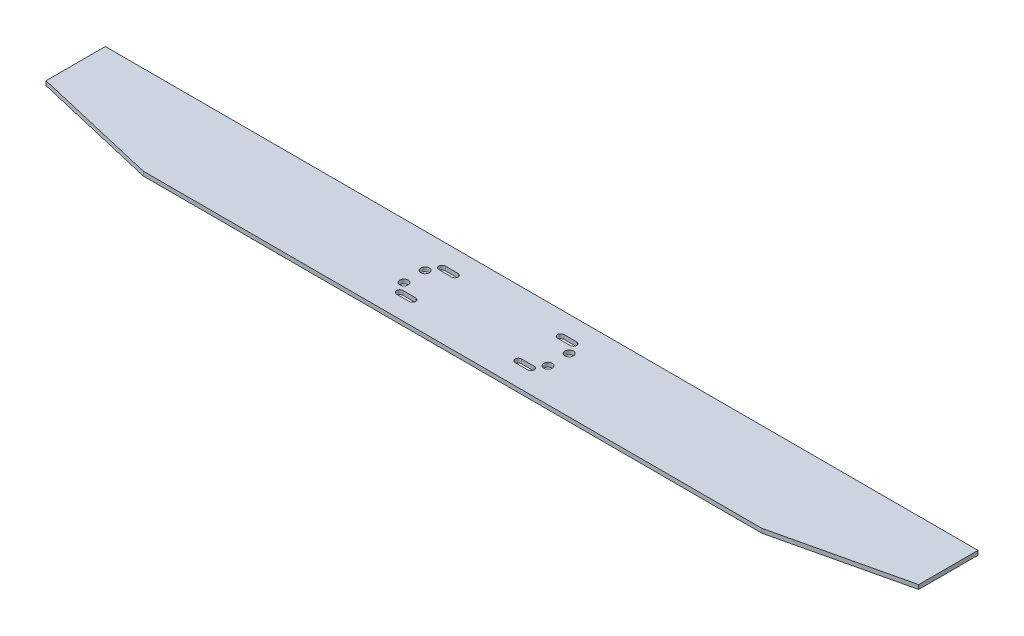
ISO-10303-21;
HEADER;
FILE_DESCRIPTION(('STEP AP214'),'2;1');
FILE_NAME('part.step','',(''),(''),'','','');
FILE_SCHEMA(('AUTOMOTIVE_DESIGN { 1 0 10303 214 1 1 1 1 }'));
ENDSEC;
DATA;
#1=APPLICATION_CONTEXT('core data for automotive mechanical design processes');
#2=APPLICATION_PROTOCOL_DEFINITION('international standard','automotive_design',2000,#1);
#3=PRODUCT_CONTEXT('',#1,'mechanical');
#4=PRODUCT('Part','Part','',(#3));
#5=PRODUCT_RELATED_PRODUCT_CATEGORY('part','',(#4));
#6=PRODUCT_DEFINITION_FORMATION('','',#4);
#7=PRODUCT_DEFINITION_CONTEXT('part definition',#1,'design');
#8=PRODUCT_DEFINITION('design','',#6,#7);
#9=PRODUCT_DEFINITION_SHAPE('','',#8);
#10=(LENGTH_UNIT() NAMED_UNIT(*) SI_UNIT(.MILLI.,.METRE.));
#11=(NAMED_UNIT(*) PLANE_ANGLE_UNIT() SI_UNIT($,.RADIAN.));
#12=(NAMED_UNIT(*) SI_UNIT($,.STERADIAN.) SOLID_ANGLE_UNIT());
#13=UNCERTAINTY_MEASURE_WITH_UNIT(LENGTH_MEASURE(1.E-05),#10,'distance_accuracy_value','');
#14=(GEOMETRIC_REPRESENTATION_CONTEXT(3) GLOBAL_UNCERTAINTY_ASSIGNED_CONTEXT((#13)) GLOBAL_UNIT_ASSIGNED_CONTEXT((#10,
#11,#12)) REPRESENTATION_CONTEXT('',''));
#15=CARTESIAN_POINT('',(0.,0.,0.));
#16=DIRECTION('',(0.,0.,1.));
#17=DIRECTION('',(1.,0.,0.));
#18=AXIS2_PLACEMENT_3D('',#15,#16,#17);
#19=CARTESIAN_POINT('',(-103.,0.5,14.));
#20=DIRECTION('',(0.227229615606418,0.,-0.973841209741793));
#21=DIRECTION('',(-0.973841209741793,0.,-0.227229615606418));
#22=AXIS2_PLACEMENT_3D('',#19,#20,#21);
#23=PLANE('',#22);
#24=DIRECTION('',(0.973841209741793,0.,0.227229615606418));
#25=VECTOR('',#24,1.);
#26=CARTESIAN_POINT('',(-103.,-0.5,14.));
#27=LINE('',#26,#25);
#28=CARTESIAN_POINT('',(-103.,-0.5,14.));
#29=VERTEX_POINT('',#28);
#30=CARTESIAN_POINT('',(-73.,-0.5,21.));
#31=VERTEX_POINT('',#30);
#32=EDGE_CURVE('E285',#29,#31,#27,.T.);
#33=ORIENTED_EDGE('',*,*,#32,.T.);
#34=DIRECTION('',(0.,-1.,0.));
#35=VECTOR('',#34,1.);
#36=CARTESIAN_POINT('',(-73.,0.5,21.));
#37=LINE('',#36,#35);
#38=CARTESIAN_POINT('',(-73.,0.5,21.));
#39=VERTEX_POINT('',#38);
#40=EDGE_CURVE('E11',#39,#31,#37,.T.);
#41=ORIENTED_EDGE('',*,*,#40,.F.);
#42=DIRECTION('',(0.973841209741793,0.,0.227229615606418));
#43=VECTOR('',#42,1.);
#44=CARTESIAN_POINT('',(-103.,0.5,14.));
#45=LINE('',#44,#43);
#46=CARTESIAN_POINT('',(-103.,0.5,14.));
#47=VERTEX_POINT('',#46);
#48=EDGE_CURVE('E293',#47,#39,#45,.T.);
#49=ORIENTED_EDGE('',*,*,#48,.F.);
#50=DIRECTION('',(0.,-1.,0.));
#51=VECTOR('',#50,1.);
#52=CARTESIAN_POINT('',(-103.,0.5,14.));
#53=LINE('',#52,#51);
#54=EDGE_CURVE('E307',#47,#29,#53,.T.);
#55=ORIENTED_EDGE('',*,*,#54,.T.);
#56=EDGE_LOOP('',(#33,#41,#49,#55));
#57=FACE_BOUND('',#56,.T.);
#58=ADVANCED_FACE('F35',(#57),#23,.F.);
#59=CARTESIAN_POINT('',(-73.,0.5,21.));
#60=DIRECTION('',(0.,0.,-1.));
#61=DIRECTION('',(-1.,0.,0.));
#62=AXIS2_PLACEMENT_3D('',#59,#60,#61);
#63=PLANE('',#62);
#64=DIRECTION('',(1.,0.,0.));
#65=VECTOR('',#64,1.);
#66=CARTESIAN_POINT('',(-73.,-0.5,21.));
#67=LINE('',#66,#65);
#68=CARTESIAN_POINT('',(73.,-0.5,21.));
#69=VERTEX_POINT('',#68);
#70=EDGE_CURVE('E310',#31,#69,#67,.T.);
#71=ORIENTED_EDGE('',*,*,#70,.T.);
#72=DIRECTION('',(0.,-1.,0.));
#73=VECTOR('',#72,1.);
#74=CARTESIAN_POINT('',(73.,0.5,21.));
#75=LINE('',#74,#73);
#76=CARTESIAN_POINT('',(73.,0.5,21.));
#77=VERTEX_POINT('',#76);
#78=EDGE_CURVE('E42',#77,#69,#75,.T.);
#79=ORIENTED_EDGE('',*,*,#78,.F.);
#80=DIRECTION('',(1.,0.,0.));
#81=VECTOR('',#80,1.);
#82=CARTESIAN_POINT('',(-73.,0.5,21.));
#83=LINE('',#82,#81);
#84=EDGE_CURVE('E296',#39,#77,#83,.T.);
#85=ORIENTED_EDGE('',*,*,#84,.F.);
#86=ORIENTED_EDGE('',*,*,#40,.T.);
#87=EDGE_LOOP('',(#71,#79,#85,#86));
#88=FACE_BOUND('',#87,.T.);
#89=ADVANCED_FACE('F356',(#88),#63,.F.);
#90=CARTESIAN_POINT('',(73.,0.5,21.));
#91=DIRECTION('',(-0.227229615606419,0.,-0.973841209741793));
#92=DIRECTION('',(-0.973841209741793,0.,0.227229615606419));
#93=AXIS2_PLACEMENT_3D('',#90,#91,#92);
#94=PLANE('',#93);
#95=DIRECTION('',(0.973841209741793,0.,-0.227229615606419));
#96=VECTOR('',#95,1.);
#97=CARTESIAN_POINT('',(73.,-0.5,21.));
#98=LINE('',#97,#96);
#99=CARTESIAN_POINT('',(103.,-0.5,14.));
#100=VERTEX_POINT('',#99);
#101=EDGE_CURVE('E312',#69,#100,#98,.T.);
#102=ORIENTED_EDGE('',*,*,#101,.T.);
#103=DIRECTION('',(0.,-1.,0.));
#104=VECTOR('',#103,1.);
#105=CARTESIAN_POINT('',(103.,0.5,14.));
#106=LINE('',#105,#104);
#107=CARTESIAN_POINT('',(103.,0.5,14.));
#108=VERTEX_POINT('',#107);
#109=EDGE_CURVE('E327',#108,#100,#106,.T.);
#110=ORIENTED_EDGE('',*,*,#109,.F.);
#111=DIRECTION('',(0.973841209741793,0.,-0.227229615606419));
#112=VECTOR('',#111,1.);
#113=CARTESIAN_POINT('',(73.,0.5,21.));
#114=LINE('',#113,#112);
#115=EDGE_CURVE('E299',#77,#108,#114,.T.);
#116=ORIENTED_EDGE('',*,*,#115,.F.);
#117=ORIENTED_EDGE('',*,*,#78,.T.);
#118=EDGE_LOOP('',(#102,#110,#116,#117));
#119=FACE_BOUND('',#118,.T.);
#120=ADVANCED_FACE('F334',(#119),#94,.F.);
#121=CARTESIAN_POINT('',(103.,0.5,14.));
#122=DIRECTION('',(-1.,0.,0.));
#123=DIRECTION('',(0.,0.,1.));
#124=AXIS2_PLACEMENT_3D('',#121,#122,#123);
#125=PLANE('',#124);
#126=DIRECTION('',(0.,0.,-1.));
#127=VECTOR('',#126,1.);
#128=CARTESIAN_POINT('',(103.,-0.5,14.));
#129=LINE('',#128,#127);
#130=CARTESIAN_POINT('',(103.,-0.5,0.));
#131=VERTEX_POINT('',#130);
#132=EDGE_CURVE('E314',#100,#131,#129,.T.);
#133=ORIENTED_EDGE('',*,*,#132,.T.);
#134=DIRECTION('',(0.,-1.,0.));
#135=VECTOR('',#134,1.);
#136=CARTESIAN_POINT('',(103.,0.5,0.));
#137=LINE('',#136,#135);
#138=CARTESIAN_POINT('',(103.,0.5,0.));
#139=VERTEX_POINT('',#138);
#140=EDGE_CURVE('E324',#139,#131,#137,.T.);
#141=ORIENTED_EDGE('',*,*,#140,.F.);
#142=DIRECTION('',(0.,0.,-1.));
#143=VECTOR('',#142,1.);
#144=CARTESIAN_POINT('',(103.,0.5,14.));
#145=LINE('',#144,#143);
#146=EDGE_CURVE('E301',#108,#139,#145,.T.);
#147=ORIENTED_EDGE('',*,*,#146,.F.);
#148=ORIENTED_EDGE('',*,*,#109,.T.);
#149=EDGE_LOOP('',(#133,#141,#147,#148));
#150=FACE_BOUND('',#149,.T.);
#151=ADVANCED_FACE('F345',(#150),#125,.F.);
#152=CARTESIAN_POINT('',(103.,0.5,0.));
#153=DIRECTION('',(0.,0.,1.));
#154=DIRECTION('',(1.,0.,0.));
#155=AXIS2_PLACEMENT_3D('',#152,#153,#154);
#156=PLANE('',#155);
#157=DIRECTION('',(-1.,0.,0.));
#158=VECTOR('',#157,1.);
#159=CARTESIAN_POINT('',(103.,-0.5,0.));
#160=LINE('',#159,#158);
#161=CARTESIAN_POINT('',(-103.,-0.5,0.));
#162=VERTEX_POINT('',#161);
#163=EDGE_CURVE('E316',#131,#162,#160,.T.);
#164=ORIENTED_EDGE('',*,*,#163,.T.);
#165=DIRECTION('',(0.,-1.,0.));
#166=VECTOR('',#165,1.);
#167=CARTESIAN_POINT('',(-103.,0.5,0.));
#168=LINE('',#167,#166);
#169=CARTESIAN_POINT('',(-103.,0.5,0.));
#170=VERTEX_POINT('',#169);
#171=EDGE_CURVE('E321',#170,#162,#168,.T.);
#172=ORIENTED_EDGE('',*,*,#171,.F.);
#173=DIRECTION('',(-1.,0.,0.));
#174=VECTOR('',#173,1.);
#175=CARTESIAN_POINT('',(103.,0.5,0.));
#176=LINE('',#175,#174);
#177=EDGE_CURVE('E303',#139,#170,#176,.T.);
#178=ORIENTED_EDGE('',*,*,#177,.F.);
#179=ORIENTED_EDGE('',*,*,#140,.T.);
#180=EDGE_LOOP('',(#164,#172,#178,#179));
#181=FACE_BOUND('',#180,.T.);
#182=ADVANCED_FACE('F349',(#181),#156,.F.);
#183=CARTESIAN_POINT('',(-103.,0.5,0.));
#184=DIRECTION('',(1.,0.,0.));
#185=DIRECTION('',(0.,0.,-1.));
#186=AXIS2_PLACEMENT_3D('',#183,#184,#185);
#187=PLANE('',#186);
#188=DIRECTION('',(0.,0.,1.));
#189=VECTOR('',#188,1.);
#190=CARTESIAN_POINT('',(-103.,-0.5,0.));
#191=LINE('',#190,#189);
#192=EDGE_CURVE('E297',#162,#29,#191,.T.);
#193=ORIENTED_EDGE('',*,*,#192,.T.);
#194=ORIENTED_EDGE('',*,*,#54,.F.);
#195=DIRECTION('',(0.,0.,1.));
#196=VECTOR('',#195,1.);
#197=CARTESIAN_POINT('',(-103.,0.5,0.));
#198=LINE('',#197,#196);
#199=EDGE_CURVE('E305',#170,#47,#198,.T.);
#200=ORIENTED_EDGE('',*,*,#199,.F.);
#201=ORIENTED_EDGE('',*,*,#171,.T.);
#202=EDGE_LOOP('',(#193,#194,#200,#201));
#203=FACE_BOUND('',#202,.T.);
#204=ADVANCED_FACE('F359',(#203),#187,.F.);
#205=CARTESIAN_POINT('',(0.,0.5,0.));
#206=DIRECTION('',(0.,1.,0.));
#207=DIRECTION('',(0.,0.,1.));
#208=AXIS2_PLACEMENT_3D('',#205,#206,#207);
#209=PLANE('',#208);
#210=CARTESIAN_POINT('',(10.,0.5,5.49999999999997));
#211=DIRECTION('',(0.,1.,0.));
#212=DIRECTION('',(0.,0.,1.));
#213=AXIS2_PLACEMENT_3D('',#210,#211,#212);
#214=CIRCLE('',#213,0.75);
#215=CARTESIAN_POINT('',(10.,0.5,4.74999999999997));
#216=VERTEX_POINT('',#215);
#217=CARTESIAN_POINT('',(10.,0.5,6.24999999999997));
#218=VERTEX_POINT('',#217);
#219=EDGE_CURVE('E611',#216,#218,#214,.T.);
#220=ORIENTED_EDGE('',*,*,#219,.F.);
#221=DIRECTION('',(-1.,0.,0.));
#222=VECTOR('',#221,1.);
#223=CARTESIAN_POINT('',(10.,0.5,4.74999999999997));
#224=LINE('',#223,#222);
#225=CARTESIAN_POINT('',(13.,0.5,4.74999999999997));
#226=VERTEX_POINT('',#225);
#227=EDGE_CURVE('E217',#226,#216,#224,.T.);
#228=ORIENTED_EDGE('',*,*,#227,.F.);
#229=CARTESIAN_POINT('',(13.,0.5,5.49999999999997));
#230=DIRECTION('',(0.,1.,0.));
#231=DIRECTION('',(0.,0.,1.));
#232=AXIS2_PLACEMENT_3D('',#229,#230,#231);
#233=CIRCLE('',#232,0.75);
#234=CARTESIAN_POINT('',(13.,0.5,6.24999999999997));
#235=VERTEX_POINT('',#234);
#236=EDGE_CURVE('E618',#235,#226,#233,.T.);
#237=ORIENTED_EDGE('',*,*,#236,.F.);
#238=DIRECTION('',(1.,0.,0.));
#239=VECTOR('',#238,1.);
#240=CARTESIAN_POINT('',(10.,0.5,6.24999999999997));
#241=LINE('',#240,#239);
#242=EDGE_CURVE('E275',#218,#235,#241,.T.);
#243=ORIENTED_EDGE('',*,*,#242,.F.);
#244=EDGE_LOOP('',(#220,#228,#237,#243));
#245=FACE_BOUND('',#244,.T.);
#246=CARTESIAN_POINT('',(-15.,0.5,15.4999999999999));
#247=DIRECTION('',(0.,1.,0.));
#248=DIRECTION('',(0.,0.,1.));
#249=AXIS2_PLACEMENT_3D('',#246,#247,#248);
#250=CIRCLE('',#249,0.750000000000006);
#251=CARTESIAN_POINT('',(-15.,0.5,16.25));
#252=VERTEX_POINT('',#251);
#253=CARTESIAN_POINT('',(-15.,0.5,14.7499999999999));
#254=VERTEX_POINT('',#253);
#255=EDGE_CURVE('E49',#252,#254,#250,.T.);
#256=ORIENTED_EDGE('',*,*,#255,.F.);
#257=DIRECTION('',(1.,0.,0.));
#258=VECTOR('',#257,1.);
#259=CARTESIAN_POINT('',(-18.,0.5,16.25));
#260=LINE('',#259,#258);
#261=CARTESIAN_POINT('',(-18.,0.5,16.25));
#262=VERTEX_POINT('',#261);
#263=EDGE_CURVE('E201',#262,#252,#260,.T.);
#264=ORIENTED_EDGE('',*,*,#263,.F.);
#265=CARTESIAN_POINT('',(-18.,0.5,15.4999999999999));
#266=DIRECTION('',(0.,1.,0.));
#267=DIRECTION('',(0.,0.,1.));
#268=AXIS2_PLACEMENT_3D('',#265,#266,#267);
#269=CIRCLE('',#268,0.750000000000005);
#270=CARTESIAN_POINT('',(-18.,0.5,14.7499999999999));
#271=VERTEX_POINT('',#270);
#272=EDGE_CURVE('E182',#271,#262,#269,.T.);
#273=ORIENTED_EDGE('',*,*,#272,.F.);
#274=DIRECTION('',(-1.,0.,0.));
#275=VECTOR('',#274,1.);
#276=CARTESIAN_POINT('',(-18.,0.5,14.7499999999999));
#277=LINE('',#276,#275);
#278=EDGE_CURVE('E209',#254,#271,#277,.T.);
#279=ORIENTED_EDGE('',*,*,#278,.F.);
#280=EDGE_LOOP('',(#256,#264,#273,#279));
#281=FACE_BOUND('',#280,.T.);
#282=CARTESIAN_POINT('',(-15.,0.5,5.49999999999997));
#283=DIRECTION('',(0.,1.,0.));
#284=DIRECTION('',(0.,0.,1.));
#285=AXIS2_PLACEMENT_3D('',#282,#283,#284);
#286=CIRCLE('',#285,0.75);
#287=CARTESIAN_POINT('',(-15.,0.5,6.24999999999997));
#288=VERTEX_POINT('',#287);
#289=CARTESIAN_POINT('',(-15.,0.5,4.74999999999997));
#290=VERTEX_POINT('',#289);
#291=EDGE_CURVE('E634',#288,#290,#286,.T.);
#292=ORIENTED_EDGE('',*,*,#291,.F.);
#293=DIRECTION('',(1.,0.,0.));
#294=VECTOR('',#293,1.);
#295=CARTESIAN_POINT('',(-18.,0.5,6.24999999999997));
#296=LINE('',#295,#294);
#297=CARTESIAN_POINT('',(-18.,0.5,6.24999999999997));
#298=VERTEX_POINT('',#297);
#299=EDGE_CURVE('E247',#298,#288,#296,.T.);
#300=ORIENTED_EDGE('',*,*,#299,.F.);
#301=CARTESIAN_POINT('',(-18.,0.5,5.49999999999997));
#302=DIRECTION('',(0.,1.,0.));
#303=DIRECTION('',(0.,0.,1.));
#304=AXIS2_PLACEMENT_3D('',#301,#302,#303);
#305=CIRCLE('',#304,0.749999999999998);
#306=CARTESIAN_POINT('',(-18.,0.5,4.74999999999997));
#307=VERTEX_POINT('',#306);
#308=EDGE_CURVE('E633',#307,#298,#305,.T.);
#309=ORIENTED_EDGE('',*,*,#308,.F.);
#310=DIRECTION('',(-1.,0.,0.));
#311=VECTOR('',#310,1.);
#312=CARTESIAN_POINT('',(-18.,0.5,4.74999999999997));
#313=LINE('',#312,#311);
#314=EDGE_CURVE('E251',#290,#307,#313,.T.);
#315=ORIENTED_EDGE('',*,*,#314,.F.);
#316=EDGE_LOOP('',(#292,#300,#309,#315));
#317=FACE_BOUND('',#316,.T.);
#318=CARTESIAN_POINT('',(9.99999999999999,0.5,15.5));
#319=DIRECTION('',(0.,1.,0.));
#320=DIRECTION('',(0.,0.,1.));
#321=AXIS2_PLACEMENT_3D('',#318,#319,#320);
#322=CIRCLE('',#321,0.749999999999991);
#323=CARTESIAN_POINT('',(9.99999999999999,0.5,14.75));
#324=VERTEX_POINT('',#323);
#325=CARTESIAN_POINT('',(9.99999999999999,0.5,16.2499999999999));
#326=VERTEX_POINT('',#325);
#327=EDGE_CURVE('E695',#324,#326,#322,.T.);
#328=ORIENTED_EDGE('',*,*,#327,.F.);
#329=DIRECTION('',(-1.,0.,0.));
#330=VECTOR('',#329,1.);
#331=CARTESIAN_POINT('',(9.99999999999999,0.5,14.75));
#332=LINE('',#331,#330);
#333=CARTESIAN_POINT('',(13.,0.5,14.75));
#334=VERTEX_POINT('',#333);
#335=EDGE_CURVE('E230',#334,#324,#332,.T.);
#336=ORIENTED_EDGE('',*,*,#335,.F.);
#337=CARTESIAN_POINT('',(13.,0.5,15.5));
#338=DIRECTION('',(0.,1.,0.));
#339=DIRECTION('',(0.,0.,1.));
#340=AXIS2_PLACEMENT_3D('',#337,#338,#339);
#341=CIRCLE('',#340,0.749999999999991);
#342=CARTESIAN_POINT('',(13.,0.5,16.2499999999999));
#343=VERTEX_POINT('',#342);
#344=EDGE_CURVE('E57',#343,#334,#341,.T.);
#345=ORIENTED_EDGE('',*,*,#344,.F.);
#346=DIRECTION('',(1.,0.,0.));
#347=VECTOR('',#346,1.);
#348=CARTESIAN_POINT('',(9.99999999999999,0.5,16.25));
#349=LINE('',#348,#347);
#350=EDGE_CURVE('E226',#326,#343,#349,.T.);
#351=ORIENTED_EDGE('',*,*,#350,.F.);
#352=EDGE_LOOP('',(#328,#336,#345,#351));
#353=FACE_BOUND('',#352,.T.);
#354=CARTESIAN_POINT('',(14.5,0.5,13.));
#355=DIRECTION('',(0.,1.,0.));
#356=DIRECTION('',(0.,0.,1.));
#357=AXIS2_PLACEMENT_3D('',#354,#355,#356);
#358=CIRCLE('',#357,1.);
#359=CARTESIAN_POINT('',(14.5,0.5,14.));
#360=VERTEX_POINT('',#359);
#361=EDGE_CURVE('E267',#360,#360,#358,.T.);
#362=ORIENTED_EDGE('',*,*,#361,.F.);
#363=EDGE_LOOP('',(#362));
#364=FACE_BOUND('',#363,.T.);
#365=CARTESIAN_POINT('',(14.5,0.5,7.99999999999996));
#366=DIRECTION('',(0.,1.,0.));
#367=DIRECTION('',(0.,0.,1.));
#368=AXIS2_PLACEMENT_3D('',#365,#366,#367);
#369=CIRCLE('',#368,1.);
#370=CARTESIAN_POINT('',(14.5,0.5,8.99999999999996));
#371=VERTEX_POINT('',#370);
#372=EDGE_CURVE('E644',#371,#371,#369,.T.);
#373=ORIENTED_EDGE('',*,*,#372,.F.);
#374=EDGE_LOOP('',(#373));
#375=FACE_BOUND('',#374,.T.);
#376=CARTESIAN_POINT('',(-19.5,0.5,7.99999999999996));
#377=DIRECTION('',(0.,1.,0.));
#378=DIRECTION('',(0.,0.,-1.));
#379=AXIS2_PLACEMENT_3D('',#376,#377,#378);
#380=CIRCLE('',#379,1.00000000000001);
#381=CARTESIAN_POINT('',(-19.5,0.5,6.99999999999995));
#382=VERTEX_POINT('',#381);
#383=EDGE_CURVE('E650',#382,#382,#380,.T.);
#384=ORIENTED_EDGE('',*,*,#383,.F.);
#385=EDGE_LOOP('',(#384));
#386=FACE_BOUND('',#385,.T.);
#387=CARTESIAN_POINT('',(-19.5,0.5,13.));
#388=DIRECTION('',(0.,1.,0.));
#389=DIRECTION('',(0.,0.,-1.));
#390=AXIS2_PLACEMENT_3D('',#387,#388,#389);
#391=CIRCLE('',#390,1.00000000000001);
#392=CARTESIAN_POINT('',(-19.5,0.5,11.9999999999999));
#393=VERTEX_POINT('',#392);
#394=EDGE_CURVE('E640',#393,#393,#391,.T.);
#395=ORIENTED_EDGE('',*,*,#394,.F.);
#396=EDGE_LOOP('',(#395));
#397=FACE_BOUND('',#396,.T.);
#398=ORIENTED_EDGE('',*,*,#48,.T.);
#399=ORIENTED_EDGE('',*,*,#84,.T.);
#400=ORIENTED_EDGE('',*,*,#115,.T.);
#401=ORIENTED_EDGE('',*,*,#146,.T.);
#402=ORIENTED_EDGE('',*,*,#177,.T.);
#403=ORIENTED_EDGE('',*,*,#199,.T.);
#404=EDGE_LOOP('',(#398,#399,#400,#401,#402,#403));
#405=FACE_BOUND('',#404,.T.);
#406=ADVANCED_FACE('F206',(#245,#281,#317,#353,#364,#375,#386,#397,#405),#209,.T.);
#407=CARTESIAN_POINT('',(0.,-0.5,0.));
#408=DIRECTION('',(0.,1.,0.));
#409=DIRECTION('',(0.,0.,1.));
#410=AXIS2_PLACEMENT_3D('',#407,#408,#409);
#411=PLANE('',#410);
#412=DIRECTION('',(1.,0.,0.));
#413=VECTOR('',#412,1.);
#414=CARTESIAN_POINT('',(-18.,-0.5,16.25));
#415=LINE('',#414,#413);
#416=CARTESIAN_POINT('',(-18.,-0.5,16.25));
#417=VERTEX_POINT('',#416);
#418=CARTESIAN_POINT('',(-15.,-0.5,16.25));
#419=VERTEX_POINT('',#418);
#420=EDGE_CURVE('E203',#417,#419,#415,.T.);
#421=ORIENTED_EDGE('',*,*,#420,.T.);
#422=CARTESIAN_POINT('',(-15.,-0.5,15.4999999999999));
#423=DIRECTION('',(0.,1.,0.));
#424=DIRECTION('',(0.,0.,1.));
#425=AXIS2_PLACEMENT_3D('',#422,#423,#424);
#426=CIRCLE('',#425,0.750000000000006);
#427=CARTESIAN_POINT('',(-15.,-0.5,14.7499999999999));
#428=VERTEX_POINT('',#427);
#429=EDGE_CURVE('E194',#419,#428,#426,.T.);
#430=ORIENTED_EDGE('',*,*,#429,.T.);
#431=DIRECTION('',(-1.,0.,0.));
#432=VECTOR('',#431,1.);
#433=CARTESIAN_POINT('',(-18.,-0.5,14.7499999999999));
#434=LINE('',#433,#432);
#435=CARTESIAN_POINT('',(-18.,-0.5,14.7499999999999));
#436=VERTEX_POINT('',#435);
#437=EDGE_CURVE('E208',#428,#436,#434,.T.);
#438=ORIENTED_EDGE('',*,*,#437,.T.);
#439=CARTESIAN_POINT('',(-18.,-0.5,15.4999999999999));
#440=DIRECTION('',(0.,1.,0.));
#441=DIRECTION('',(0.,0.,1.));
#442=AXIS2_PLACEMENT_3D('',#439,#440,#441);
#443=CIRCLE('',#442,0.750000000000005);
#444=EDGE_CURVE('E193',#436,#417,#443,.T.);
#445=ORIENTED_EDGE('',*,*,#444,.T.);
#446=EDGE_LOOP('',(#421,#430,#438,#445));
#447=FACE_BOUND('',#446,.T.);
#448=DIRECTION('',(-1.,0.,0.));
#449=VECTOR('',#448,1.);
#450=CARTESIAN_POINT('',(9.99999999999999,-0.5,14.75));
#451=LINE('',#450,#449);
#452=CARTESIAN_POINT('',(13.,-0.5,14.75));
#453=VERTEX_POINT('',#452);
#454=CARTESIAN_POINT('',(9.99999999999999,-0.5,14.75));
#455=VERTEX_POINT('',#454);
#456=EDGE_CURVE('E222',#453,#455,#451,.T.);
#457=ORIENTED_EDGE('',*,*,#456,.T.);
#458=CARTESIAN_POINT('',(9.99999999999999,-0.5,15.5));
#459=DIRECTION('',(0.,1.,0.));
#460=DIRECTION('',(0.,0.,1.));
#461=AXIS2_PLACEMENT_3D('',#458,#459,#460);
#462=CIRCLE('',#461,0.749999999999991);
#463=CARTESIAN_POINT('',(9.99999999999999,-0.5,16.2499999999999));
#464=VERTEX_POINT('',#463);
#465=EDGE_CURVE('E629',#455,#464,#462,.T.);
#466=ORIENTED_EDGE('',*,*,#465,.T.);
#467=DIRECTION('',(1.,0.,0.));
#468=VECTOR('',#467,1.);
#469=CARTESIAN_POINT('',(9.99999999999999,-0.5,16.25));
#470=LINE('',#469,#468);
#471=CARTESIAN_POINT('',(13.,-0.5,16.2499999999999));
#472=VERTEX_POINT('',#471);
#473=EDGE_CURVE('E225',#464,#472,#470,.T.);
#474=ORIENTED_EDGE('',*,*,#473,.T.);
#475=CARTESIAN_POINT('',(13.,-0.5,15.5));
#476=DIRECTION('',(0.,1.,0.));
#477=DIRECTION('',(0.,0.,1.));
#478=AXIS2_PLACEMENT_3D('',#475,#476,#477);
#479=CIRCLE('',#478,0.749999999999991);
#480=EDGE_CURVE('E620',#472,#453,#479,.T.);
#481=ORIENTED_EDGE('',*,*,#480,.T.);
#482=EDGE_LOOP('',(#457,#466,#474,#481));
#483=FACE_BOUND('',#482,.T.);
#484=DIRECTION('',(1.,0.,0.));
#485=VECTOR('',#484,1.);
#486=CARTESIAN_POINT('',(-18.,-0.5,6.24999999999997));
#487=LINE('',#486,#485);
#488=CARTESIAN_POINT('',(-18.,-0.5,6.24999999999997));
#489=VERTEX_POINT('',#488);
#490=CARTESIAN_POINT('',(-15.,-0.5,6.24999999999997));
#491=VERTEX_POINT('',#490);
#492=EDGE_CURVE('E246',#489,#491,#487,.T.);
#493=ORIENTED_EDGE('',*,*,#492,.T.);
#494=CARTESIAN_POINT('',(-15.,-0.5,5.49999999999997));
#495=DIRECTION('',(0.,1.,0.));
#496=DIRECTION('',(0.,0.,1.));
#497=AXIS2_PLACEMENT_3D('',#494,#495,#496);
#498=CIRCLE('',#497,0.75);
#499=CARTESIAN_POINT('',(-15.,-0.5,4.74999999999997));
#500=VERTEX_POINT('',#499);
#501=EDGE_CURVE('E630',#491,#500,#498,.T.);
#502=ORIENTED_EDGE('',*,*,#501,.T.);
#503=DIRECTION('',(-1.,0.,0.));
#504=VECTOR('',#503,1.);
#505=CARTESIAN_POINT('',(-18.,-0.5,4.74999999999997));
#506=LINE('',#505,#504);
#507=CARTESIAN_POINT('',(-18.,-0.5,4.74999999999997));
#508=VERTEX_POINT('',#507);
#509=EDGE_CURVE('E243',#500,#508,#506,.T.);
#510=ORIENTED_EDGE('',*,*,#509,.T.);
#511=CARTESIAN_POINT('',(-18.,-0.5,5.49999999999997));
#512=DIRECTION('',(0.,1.,0.));
#513=DIRECTION('',(0.,0.,1.));
#514=AXIS2_PLACEMENT_3D('',#511,#512,#513);
#515=CIRCLE('',#514,0.749999999999998);
#516=EDGE_CURVE('E637',#508,#489,#515,.T.);
#517=ORIENTED_EDGE('',*,*,#516,.T.);
#518=EDGE_LOOP('',(#493,#502,#510,#517));
#519=FACE_BOUND('',#518,.T.);
#520=CARTESIAN_POINT('',(14.5,-0.5,13.));
#521=DIRECTION('',(0.,1.,0.));
#522=DIRECTION('',(0.,0.,1.));
#523=AXIS2_PLACEMENT_3D('',#520,#521,#522);
#524=CIRCLE('',#523,1.);
#525=CARTESIAN_POINT('',(14.5,-0.5,14.));
#526=VERTEX_POINT('',#525);
#527=EDGE_CURVE('E254',#526,#526,#524,.T.);
#528=ORIENTED_EDGE('',*,*,#527,.T.);
#529=EDGE_LOOP('',(#528));
#530=FACE_BOUND('',#529,.T.);
#531=CARTESIAN_POINT('',(14.5,-0.5,7.99999999999996));
#532=DIRECTION('',(0.,1.,0.));
#533=DIRECTION('',(0.,0.,1.));
#534=AXIS2_PLACEMENT_3D('',#531,#532,#533);
#535=CIRCLE('',#534,1.);
#536=CARTESIAN_POINT('',(14.5,-0.5,8.99999999999996));
#537=VERTEX_POINT('',#536);
#538=EDGE_CURVE('E270',#537,#537,#535,.T.);
#539=ORIENTED_EDGE('',*,*,#538,.T.);
#540=EDGE_LOOP('',(#539));
#541=FACE_BOUND('',#540,.T.);
#542=CARTESIAN_POINT('',(-19.5,-0.5,7.99999999999996));
#543=DIRECTION('',(0.,1.,0.));
#544=DIRECTION('',(0.,0.,-1.));
#545=AXIS2_PLACEMENT_3D('',#542,#543,#544);
#546=CIRCLE('',#545,1.00000000000001);
#547=CARTESIAN_POINT('',(-19.5,-0.5,6.99999999999995));
#548=VERTEX_POINT('',#547);
#549=EDGE_CURVE('E647',#548,#548,#546,.T.);
#550=ORIENTED_EDGE('',*,*,#549,.T.);
#551=EDGE_LOOP('',(#550));
#552=FACE_BOUND('',#551,.T.);
#553=CARTESIAN_POINT('',(-19.5,-0.5,13.));
#554=DIRECTION('',(0.,1.,0.));
#555=DIRECTION('',(0.,0.,-1.));
#556=AXIS2_PLACEMENT_3D('',#553,#554,#555);
#557=CIRCLE('',#556,1.00000000000001);
#558=CARTESIAN_POINT('',(-19.5,-0.5,11.9999999999999));
#559=VERTEX_POINT('',#558);
#560=EDGE_CURVE('E653',#559,#559,#557,.T.);
#561=ORIENTED_EDGE('',*,*,#560,.T.);
#562=EDGE_LOOP('',(#561));
#563=FACE_BOUND('',#562,.T.);
#564=DIRECTION('',(-1.,0.,0.));
#565=VECTOR('',#564,1.);
#566=CARTESIAN_POINT('',(10.,-0.5,4.74999999999997));
#567=LINE('',#566,#565);
#568=CARTESIAN_POINT('',(13.,-0.5,4.74999999999997));
#569=VERTEX_POINT('',#568);
#570=CARTESIAN_POINT('',(10.,-0.5,4.74999999999997));
#571=VERTEX_POINT('',#570);
#572=EDGE_CURVE('E271',#569,#571,#567,.T.);
#573=ORIENTED_EDGE('',*,*,#572,.T.);
#574=CARTESIAN_POINT('',(10.,-0.5,5.49999999999997));
#575=DIRECTION('',(0.,1.,0.));
#576=DIRECTION('',(0.,0.,1.));
#577=AXIS2_PLACEMENT_3D('',#574,#575,#576);
#578=CIRCLE('',#577,0.75);
#579=CARTESIAN_POINT('',(10.,-0.5,6.24999999999997));
#580=VERTEX_POINT('',#579);
#581=EDGE_CURVE('E606',#571,#580,#578,.T.);
#582=ORIENTED_EDGE('',*,*,#581,.T.);
#583=DIRECTION('',(1.,0.,0.));
#584=VECTOR('',#583,1.);
#585=CARTESIAN_POINT('',(10.,-0.5,6.24999999999997));
#586=LINE('',#585,#584);
#587=CARTESIAN_POINT('',(13.,-0.5,6.24999999999997));
#588=VERTEX_POINT('',#587);
#589=EDGE_CURVE('E274',#580,#588,#586,.T.);
#590=ORIENTED_EDGE('',*,*,#589,.T.);
#591=CARTESIAN_POINT('',(13.,-0.5,5.49999999999997));
#592=DIRECTION('',(0.,1.,0.));
#593=DIRECTION('',(0.,0.,1.));
#594=AXIS2_PLACEMENT_3D('',#591,#592,#593);
#595=CIRCLE('',#594,0.75);
#596=EDGE_CURVE('E616',#588,#569,#595,.T.);
#597=ORIENTED_EDGE('',*,*,#596,.T.);
#598=EDGE_LOOP('',(#573,#582,#590,#597));
#599=FACE_BOUND('',#598,.T.);
#600=ORIENTED_EDGE('',*,*,#32,.F.);
#601=ORIENTED_EDGE('',*,*,#192,.F.);
#602=ORIENTED_EDGE('',*,*,#163,.F.);
#603=ORIENTED_EDGE('',*,*,#132,.F.);
#604=ORIENTED_EDGE('',*,*,#101,.F.);
#605=ORIENTED_EDGE('',*,*,#70,.F.);
#606=EDGE_LOOP('',(#600,#601,#602,#603,#604,#605));
#607=FACE_BOUND('',#606,.T.);
#608=ADVANCED_FACE('F340',(#447,#483,#519,#530,#541,#552,#563,#599,#607),#411,.F.);
#609=CARTESIAN_POINT('',(10.,-0.5,6.24999999999997));
#610=DIRECTION('',(0.,0.,1.));
#611=DIRECTION('',(1.,0.,0.));
#612=AXIS2_PLACEMENT_3D('',#609,#610,#611);
#613=PLANE('',#612);
#614=ORIENTED_EDGE('',*,*,#242,.T.);
#615=DIRECTION('',(0.,1.,0.));
#616=VECTOR('',#615,1.);
#617=CARTESIAN_POINT('',(13.,-0.5,6.24999999999997));
#618=LINE('',#617,#616);
#619=EDGE_CURVE('E283',#588,#235,#618,.T.);
#620=ORIENTED_EDGE('',*,*,#619,.F.);
#621=ORIENTED_EDGE('',*,*,#589,.F.);
#622=DIRECTION('',(0.,1.,0.));
#623=VECTOR('',#622,1.);
#624=CARTESIAN_POINT('',(10.,-0.5,6.24999999999997));
#625=LINE('',#624,#623);
#626=EDGE_CURVE('E286',#580,#218,#625,.T.);
#627=ORIENTED_EDGE('',*,*,#626,.T.);
#628=EDGE_LOOP('',(#614,#620,#621,#627));
#629=FACE_BOUND('',#628,.T.);
#630=ADVANCED_FACE('F454',(#629),#613,.F.);
#631=CARTESIAN_POINT('',(10.,-0.5,4.74999999999997));
#632=DIRECTION('',(0.,0.,-1.));
#633=DIRECTION('',(-1.,0.,0.));
#634=AXIS2_PLACEMENT_3D('',#631,#632,#633);
#635=PLANE('',#634);
#636=ORIENTED_EDGE('',*,*,#227,.T.);
#637=DIRECTION('',(0.,1.,0.));
#638=VECTOR('',#637,1.);
#639=CARTESIAN_POINT('',(10.,-0.5,4.74999999999997));
#640=LINE('',#639,#638);
#641=EDGE_CURVE('E289',#571,#216,#640,.T.);
#642=ORIENTED_EDGE('',*,*,#641,.F.);
#643=ORIENTED_EDGE('',*,*,#572,.F.);
#644=DIRECTION('',(0.,1.,0.));
#645=VECTOR('',#644,1.);
#646=CARTESIAN_POINT('',(13.,-0.5,4.74999999999997));
#647=LINE('',#646,#645);
#648=EDGE_CURVE('E278',#569,#226,#647,.T.);
#649=ORIENTED_EDGE('',*,*,#648,.T.);
#650=EDGE_LOOP('',(#636,#642,#643,#649));
#651=FACE_BOUND('',#650,.T.);
#652=ADVANCED_FACE('F404',(#651),#635,.F.);
#653=CARTESIAN_POINT('',(-19.5,-0.5,13.));
#654=DIRECTION('',(0.,1.,0.));
#655=DIRECTION('',(0.,0.,1.));
#656=AXIS2_PLACEMENT_3D('',#653,#654,#655);
#657=CYLINDRICAL_SURFACE('',#656,1.00000000000001);
#658=ORIENTED_EDGE('',*,*,#560,.F.);
#659=EDGE_LOOP('',(#658));
#660=FACE_BOUND('',#659,.T.);
#661=ORIENTED_EDGE('',*,*,#394,.T.);
#662=EDGE_LOOP('',(#661));
#663=FACE_BOUND('',#662,.T.);
#664=ADVANCED_FACE('F398',(#660,#663),#657,.F.);
#665=CARTESIAN_POINT('',(-19.5,-0.5,7.99999999999996));
#666=DIRECTION('',(0.,1.,0.));
#667=DIRECTION('',(0.,0.,1.));
#668=AXIS2_PLACEMENT_3D('',#665,#666,#667);
#669=CYLINDRICAL_SURFACE('',#668,1.00000000000001);
#670=ORIENTED_EDGE('',*,*,#549,.F.);
#671=EDGE_LOOP('',(#670));
#672=FACE_BOUND('',#671,.T.);
#673=ORIENTED_EDGE('',*,*,#383,.T.);
#674=EDGE_LOOP('',(#673));
#675=FACE_BOUND('',#674,.T.);
#676=ADVANCED_FACE('F403',(#672,#675),#669,.F.);
#677=CARTESIAN_POINT('',(14.5,-0.5,7.99999999999996));
#678=DIRECTION('',(0.,1.,0.));
#679=DIRECTION('',(0.,0.,1.));
#680=AXIS2_PLACEMENT_3D('',#677,#678,#679);
#681=CYLINDRICAL_SURFACE('',#680,1.);
#682=ORIENTED_EDGE('',*,*,#538,.F.);
#683=EDGE_LOOP('',(#682));
#684=FACE_BOUND('',#683,.T.);
#685=ORIENTED_EDGE('',*,*,#372,.T.);
#686=EDGE_LOOP('',(#685));
#687=FACE_BOUND('',#686,.T.);
#688=ADVANCED_FACE('F416',(#684,#687),#681,.F.);
#689=CARTESIAN_POINT('',(14.5,-0.5,13.));
#690=DIRECTION('',(0.,1.,0.));
#691=DIRECTION('',(0.,0.,1.));
#692=AXIS2_PLACEMENT_3D('',#689,#690,#691);
#693=CYLINDRICAL_SURFACE('',#692,1.);
#694=ORIENTED_EDGE('',*,*,#527,.F.);
#695=EDGE_LOOP('',(#694));
#696=FACE_BOUND('',#695,.T.);
#697=ORIENTED_EDGE('',*,*,#361,.T.);
#698=EDGE_LOOP('',(#697));
#699=FACE_BOUND('',#698,.T.);
#700=ADVANCED_FACE('F426',(#696,#699),#693,.F.);
#701=CARTESIAN_POINT('',(-18.,-0.5,6.24999999999997));
#702=DIRECTION('',(0.,0.,1.));
#703=DIRECTION('',(1.,0.,0.));
#704=AXIS2_PLACEMENT_3D('',#701,#702,#703);
#705=PLANE('',#704);
#706=ORIENTED_EDGE('',*,*,#299,.T.);
#707=DIRECTION('',(0.,1.,0.));
#708=VECTOR('',#707,1.);
#709=CARTESIAN_POINT('',(-15.,-0.5,6.24999999999997));
#710=LINE('',#709,#708);
#711=EDGE_CURVE('E233',#491,#288,#710,.T.);
#712=ORIENTED_EDGE('',*,*,#711,.F.);
#713=ORIENTED_EDGE('',*,*,#492,.F.);
#714=DIRECTION('',(0.,1.,0.));
#715=VECTOR('',#714,1.);
#716=CARTESIAN_POINT('',(-18.,-0.5,6.24999999999997));
#717=LINE('',#716,#715);
#718=EDGE_CURVE('E258',#489,#298,#717,.T.);
#719=ORIENTED_EDGE('',*,*,#718,.T.);
#720=EDGE_LOOP('',(#706,#712,#713,#719));
#721=FACE_BOUND('',#720,.T.);
#722=ADVANCED_FACE('F436',(#721),#705,.F.);
#723=CARTESIAN_POINT('',(-18.,-0.5,4.74999999999997));
#724=DIRECTION('',(0.,0.,-1.));
#725=DIRECTION('',(-1.,0.,0.));
#726=AXIS2_PLACEMENT_3D('',#723,#724,#725);
#727=PLANE('',#726);
#728=ORIENTED_EDGE('',*,*,#314,.T.);
#729=DIRECTION('',(0.,1.,0.));
#730=VECTOR('',#729,1.);
#731=CARTESIAN_POINT('',(-18.,-0.5,4.74999999999997));
#732=LINE('',#731,#730);
#733=EDGE_CURVE('E261',#508,#307,#732,.T.);
#734=ORIENTED_EDGE('',*,*,#733,.F.);
#735=ORIENTED_EDGE('',*,*,#509,.F.);
#736=DIRECTION('',(0.,1.,0.));
#737=VECTOR('',#736,1.);
#738=CARTESIAN_POINT('',(-15.,-0.5,4.74999999999997));
#739=LINE('',#738,#737);
#740=EDGE_CURVE('E250',#500,#290,#739,.T.);
#741=ORIENTED_EDGE('',*,*,#740,.T.);
#742=EDGE_LOOP('',(#728,#734,#735,#741));
#743=FACE_BOUND('',#742,.T.);
#744=ADVANCED_FACE('F477',(#743),#727,.F.);
#745=CARTESIAN_POINT('',(9.99999999999999,-0.5,16.25));
#746=DIRECTION('',(0.,0.,1.));
#747=DIRECTION('',(1.,0.,0.));
#748=AXIS2_PLACEMENT_3D('',#745,#746,#747);
#749=PLANE('',#748);
#750=ORIENTED_EDGE('',*,*,#350,.T.);
#751=DIRECTION('',(0.,1.,0.));
#752=VECTOR('',#751,1.);
#753=CARTESIAN_POINT('',(13.,-0.5,16.2499999999999));
#754=LINE('',#753,#752);
#755=EDGE_CURVE('E213',#472,#343,#754,.T.);
#756=ORIENTED_EDGE('',*,*,#755,.F.);
#757=ORIENTED_EDGE('',*,*,#473,.F.);
#758=DIRECTION('',(0.,1.,0.));
#759=VECTOR('',#758,1.);
#760=CARTESIAN_POINT('',(9.99999999999999,-0.5,16.25));
#761=LINE('',#760,#759);
#762=EDGE_CURVE('E237',#464,#326,#761,.T.);
#763=ORIENTED_EDGE('',*,*,#762,.T.);
#764=EDGE_LOOP('',(#750,#756,#757,#763));
#765=FACE_BOUND('',#764,.T.);
#766=ADVANCED_FACE('F487',(#765),#749,.F.);
#767=CARTESIAN_POINT('',(9.99999999999999,-0.5,14.75));
#768=DIRECTION('',(0.,0.,-1.));
#769=DIRECTION('',(-1.,0.,0.));
#770=AXIS2_PLACEMENT_3D('',#767,#768,#769);
#771=PLANE('',#770);
#772=ORIENTED_EDGE('',*,*,#335,.T.);
#773=DIRECTION('',(0.,1.,0.));
#774=VECTOR('',#773,1.);
#775=CARTESIAN_POINT('',(9.99999999999999,-0.5,14.75));
#776=LINE('',#775,#774);
#777=EDGE_CURVE('E240',#455,#324,#776,.T.);
#778=ORIENTED_EDGE('',*,*,#777,.F.);
#779=ORIENTED_EDGE('',*,*,#456,.F.);
#780=DIRECTION('',(0.,1.,0.));
#781=VECTOR('',#780,1.);
#782=CARTESIAN_POINT('',(13.,-0.5,14.75));
#783=LINE('',#782,#781);
#784=EDGE_CURVE('E229',#453,#334,#783,.T.);
#785=ORIENTED_EDGE('',*,*,#784,.T.);
#786=EDGE_LOOP('',(#772,#778,#779,#785));
#787=FACE_BOUND('',#786,.T.);
#788=ADVANCED_FACE('F497',(#787),#771,.F.);
#789=CARTESIAN_POINT('',(-18.,-0.5,16.25));
#790=DIRECTION('',(0.,0.,1.));
#791=DIRECTION('',(1.,0.,0.));
#792=AXIS2_PLACEMENT_3D('',#789,#790,#791);
#793=PLANE('',#792);
#794=ORIENTED_EDGE('',*,*,#263,.T.);
#795=DIRECTION('',(0.,1.,0.));
#796=VECTOR('',#795,1.);
#797=CARTESIAN_POINT('',(-15.,-0.5,16.25));
#798=LINE('',#797,#796);
#799=EDGE_CURVE('E204',#419,#252,#798,.T.);
#800=ORIENTED_EDGE('',*,*,#799,.F.);
#801=ORIENTED_EDGE('',*,*,#420,.F.);
#802=DIRECTION('',(0.,1.,0.));
#803=VECTOR('',#802,1.);
#804=CARTESIAN_POINT('',(-18.,-0.5,16.25));
#805=LINE('',#804,#803);
#806=EDGE_CURVE('E185',#417,#262,#805,.T.);
#807=ORIENTED_EDGE('',*,*,#806,.T.);
#808=EDGE_LOOP('',(#794,#800,#801,#807));
#809=FACE_BOUND('',#808,.T.);
#810=ADVANCED_FACE('F199',(#809),#793,.F.);
#811=CARTESIAN_POINT('',(-18.,-0.5,14.7499999999999));
#812=DIRECTION('',(0.,0.,-1.));
#813=DIRECTION('',(-1.,0.,0.));
#814=AXIS2_PLACEMENT_3D('',#811,#812,#813);
#815=PLANE('',#814);
#816=ORIENTED_EDGE('',*,*,#278,.T.);
#817=DIRECTION('',(0.,1.,0.));
#818=VECTOR('',#817,1.);
#819=CARTESIAN_POINT('',(-18.,-0.5,14.7499999999999));
#820=LINE('',#819,#818);
#821=EDGE_CURVE('E188',#436,#271,#820,.T.);
#822=ORIENTED_EDGE('',*,*,#821,.F.);
#823=ORIENTED_EDGE('',*,*,#437,.F.);
#824=DIRECTION('',(0.,1.,0.));
#825=VECTOR('',#824,1.);
#826=CARTESIAN_POINT('',(-15.,-0.5,14.7499999999999));
#827=LINE('',#826,#825);
#828=EDGE_CURVE('E220',#428,#254,#827,.T.);
#829=ORIENTED_EDGE('',*,*,#828,.T.);
#830=EDGE_LOOP('',(#816,#822,#823,#829));
#831=FACE_BOUND('',#830,.T.);
#832=ADVANCED_FACE('F516',(#831),#815,.F.);
#833=CARTESIAN_POINT('',(-18.,-0.5,15.4999999999999));
#834=DIRECTION('',(0.,1.,0.));
#835=DIRECTION('',(0.,0.,1.));
#836=AXIS2_PLACEMENT_3D('',#833,#834,#835);
#837=CYLINDRICAL_SURFACE('',#836,0.750000000000005);
#838=ORIENTED_EDGE('',*,*,#444,.F.);
#839=ORIENTED_EDGE('',*,*,#821,.T.);
#840=ORIENTED_EDGE('',*,*,#272,.T.);
#841=ORIENTED_EDGE('',*,*,#806,.F.);
#842=EDGE_LOOP('',(#838,#839,#840,#841));
#843=FACE_BOUND('',#842,.T.);
#844=ADVANCED_FACE('F184',(#843),#837,.F.);
#845=CARTESIAN_POINT('',(-15.,-0.5,15.4999999999999));
#846=DIRECTION('',(0.,1.,0.));
#847=DIRECTION('',(0.,0.,1.));
#848=AXIS2_PLACEMENT_3D('',#845,#846,#847);
#849=CYLINDRICAL_SURFACE('',#848,0.750000000000006);
#850=ORIENTED_EDGE('',*,*,#799,.T.);
#851=ORIENTED_EDGE('',*,*,#255,.T.);
#852=ORIENTED_EDGE('',*,*,#828,.F.);
#853=ORIENTED_EDGE('',*,*,#429,.F.);
#854=EDGE_LOOP('',(#850,#851,#852,#853));
#855=FACE_BOUND('',#854,.T.);
#856=ADVANCED_FACE('F534',(#855),#849,.F.);
#857=CARTESIAN_POINT('',(13.,-0.5,15.5));
#858=DIRECTION('',(0.,1.,0.));
#859=DIRECTION('',(0.,0.,1.));
#860=AXIS2_PLACEMENT_3D('',#857,#858,#859);
#861=CYLINDRICAL_SURFACE('',#860,0.749999999999991);
#862=ORIENTED_EDGE('',*,*,#755,.T.);
#863=ORIENTED_EDGE('',*,*,#344,.T.);
#864=ORIENTED_EDGE('',*,*,#784,.F.);
#865=ORIENTED_EDGE('',*,*,#480,.F.);
#866=EDGE_LOOP('',(#862,#863,#864,#865));
#867=FACE_BOUND('',#866,.T.);
#868=ADVANCED_FACE('F543',(#867),#861,.F.);
#869=CARTESIAN_POINT('',(9.99999999999999,-0.5,15.5));
#870=DIRECTION('',(0.,1.,0.));
#871=DIRECTION('',(0.,0.,1.));
#872=AXIS2_PLACEMENT_3D('',#869,#870,#871);
#873=CYLINDRICAL_SURFACE('',#872,0.749999999999991);
#874=ORIENTED_EDGE('',*,*,#465,.F.);
#875=ORIENTED_EDGE('',*,*,#777,.T.);
#876=ORIENTED_EDGE('',*,*,#327,.T.);
#877=ORIENTED_EDGE('',*,*,#762,.F.);
#878=EDGE_LOOP('',(#874,#875,#876,#877));
#879=FACE_BOUND('',#878,.T.);
#880=ADVANCED_FACE('F552',(#879),#873,.F.);
#881=CARTESIAN_POINT('',(-18.,-0.5,5.49999999999997));
#882=DIRECTION('',(0.,1.,0.));
#883=DIRECTION('',(0.,0.,1.));
#884=AXIS2_PLACEMENT_3D('',#881,#882,#883);
#885=CYLINDRICAL_SURFACE('',#884,0.749999999999998);
#886=ORIENTED_EDGE('',*,*,#516,.F.);
#887=ORIENTED_EDGE('',*,*,#733,.T.);
#888=ORIENTED_EDGE('',*,*,#308,.T.);
#889=ORIENTED_EDGE('',*,*,#718,.F.);
#890=EDGE_LOOP('',(#886,#887,#888,#889));
#891=FACE_BOUND('',#890,.T.);
#892=ADVANCED_FACE('F561',(#891),#885,.F.);
#893=CARTESIAN_POINT('',(-15.,-0.5,5.49999999999997));
#894=DIRECTION('',(0.,1.,0.));
#895=DIRECTION('',(0.,0.,1.));
#896=AXIS2_PLACEMENT_3D('',#893,#894,#895);
#897=CYLINDRICAL_SURFACE('',#896,0.75);
#898=ORIENTED_EDGE('',*,*,#711,.T.);
#899=ORIENTED_EDGE('',*,*,#291,.T.);
#900=ORIENTED_EDGE('',*,*,#740,.F.);
#901=ORIENTED_EDGE('',*,*,#501,.F.);
#902=EDGE_LOOP('',(#898,#899,#900,#901));
#903=FACE_BOUND('',#902,.T.);
#904=ADVANCED_FACE('F571',(#903),#897,.F.);
#905=CARTESIAN_POINT('',(13.,-0.5,5.49999999999997));
#906=DIRECTION('',(0.,1.,0.));
#907=DIRECTION('',(0.,0.,1.));
#908=AXIS2_PLACEMENT_3D('',#905,#906,#907);
#909=CYLINDRICAL_SURFACE('',#908,0.75);
#910=ORIENTED_EDGE('',*,*,#619,.T.);
#911=ORIENTED_EDGE('',*,*,#236,.T.);
#912=ORIENTED_EDGE('',*,*,#648,.F.);
#913=ORIENTED_EDGE('',*,*,#596,.F.);
#914=EDGE_LOOP('',(#910,#911,#912,#913));
#915=FACE_BOUND('',#914,.T.);
#916=ADVANCED_FACE('F581',(#915),#909,.F.);
#917=CARTESIAN_POINT('',(10.,-0.5,5.49999999999997));
#918=DIRECTION('',(0.,1.,0.));
#919=DIRECTION('',(0.,0.,1.));
#920=AXIS2_PLACEMENT_3D('',#917,#918,#919);
#921=CYLINDRICAL_SURFACE('',#920,0.75);
#922=ORIENTED_EDGE('',*,*,#581,.F.);
#923=ORIENTED_EDGE('',*,*,#641,.T.);
#924=ORIENTED_EDGE('',*,*,#219,.T.);
#925=ORIENTED_EDGE('',*,*,#626,.F.);
#926=EDGE_LOOP('',(#922,#923,#924,#925));
#927=FACE_BOUND('',#926,.T.);
#928=ADVANCED_FACE('F591',(#927),#921,.F.);
#929=CLOSED_SHELL('',(#58,#89,#120,#151,#182,#204,#406,#608,#630,#652,#664,#676,#688,#700,#722,
#744,#766,#788,#810,#832,#844,#856,#868,#880,#892,#904,#916,#928));
#930=MANIFOLD_SOLID_BREP('B2',#929);
#931=ADVANCED_BREP_SHAPE_REPRESENTATION('',(#18,#930),#14);
#932=SHAPE_DEFINITION_REPRESENTATION(#9,#931);
ENDSEC;
END-ISO-10303-21;
